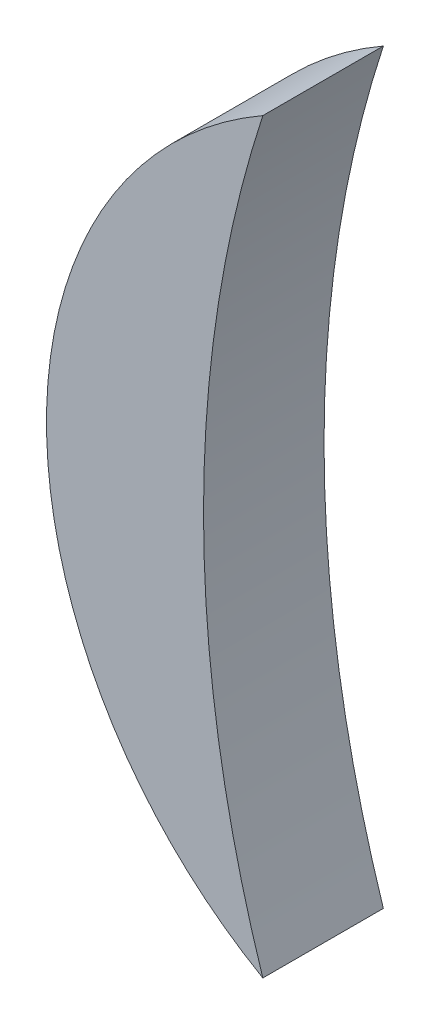
ISO-10303-21;
HEADER;
FILE_DESCRIPTION(('STEP AP214'),'2;1');
FILE_NAME('part.step','',(''),(''),'','','');
FILE_SCHEMA(('AUTOMOTIVE_DESIGN { 1 0 10303 214 1 1 1 1 }'));
ENDSEC;
DATA;
#1=APPLICATION_CONTEXT('core data for automotive mechanical design processes');
#2=APPLICATION_PROTOCOL_DEFINITION('international standard','automotive_design',2000,#1);
#3=PRODUCT_CONTEXT('',#1,'mechanical');
#4=PRODUCT('Part','Part','',(#3));
#5=PRODUCT_RELATED_PRODUCT_CATEGORY('part','',(#4));
#6=PRODUCT_DEFINITION_FORMATION('','',#4);
#7=PRODUCT_DEFINITION_CONTEXT('part definition',#1,'design');
#8=PRODUCT_DEFINITION('design','',#6,#7);
#9=PRODUCT_DEFINITION_SHAPE('','',#8);
#10=(LENGTH_UNIT() NAMED_UNIT(*) SI_UNIT(.MILLI.,.METRE.));
#11=(NAMED_UNIT(*) PLANE_ANGLE_UNIT() SI_UNIT($,.RADIAN.));
#12=(NAMED_UNIT(*) SI_UNIT($,.STERADIAN.) SOLID_ANGLE_UNIT());
#13=UNCERTAINTY_MEASURE_WITH_UNIT(LENGTH_MEASURE(1.E-05),#10,'distance_accuracy_value','');
#14=(GEOMETRIC_REPRESENTATION_CONTEXT(3) GLOBAL_UNCERTAINTY_ASSIGNED_CONTEXT((#13)) GLOBAL_UNIT_ASSIGNED_CONTEXT((#10,
#11,#12)) REPRESENTATION_CONTEXT('',''));
#15=CARTESIAN_POINT('',(0.,0.,0.));
#16=DIRECTION('',(0.,0.,1.));
#17=DIRECTION('',(1.,0.,0.));
#18=AXIS2_PLACEMENT_3D('',#15,#16,#17);
#19=CARTESIAN_POINT('',(92.8169721,102.68697268,0.));
#20=DIRECTION('',(0.,0.,-1.));
#21=DIRECTION('',(1.,0.,0.));
#22=AXIS2_PLACEMENT_3D('',#19,#20,#21);
#23=CYLINDRICAL_SURFACE('',#22,0.3556);
#24=DIRECTION('',(0.,0.,1.));
#25=VECTOR('',#24,1.);
#26=CARTESIAN_POINT('',(92.4788692440639,102.797144449559,0.));
#27=LINE('',#26,#25);
#28=CARTESIAN_POINT('',(92.4788692440639,102.797144449559,0.));
#29=VERTEX_POINT('',#28);
#30=CARTESIAN_POINT('',(92.4788692440639,102.797144449559,0.03556));
#31=VERTEX_POINT('',#30);
#32=EDGE_CURVE('E11',#29,#31,#27,.T.);
#33=ORIENTED_EDGE('',*,*,#32,.T.);
#34=CARTESIAN_POINT('',(92.8169721,102.68697268,0.03556));
#35=DIRECTION('',(0.,0.,1.));
#36=DIRECTION('',(1.,0.,0.));
#37=AXIS2_PLACEMENT_3D('',#34,#35,#36);
#38=CIRCLE('',#37,0.3556);
#39=CARTESIAN_POINT('',(92.4788692440639,102.576800910441,0.03556));
#40=VERTEX_POINT('',#39);
#41=EDGE_CURVE('E24',#31,#40,#38,.T.);
#42=ORIENTED_EDGE('',*,*,#41,.T.);
#43=DIRECTION('',(0.,0.,1.));
#44=VECTOR('',#43,1.);
#45=CARTESIAN_POINT('',(92.4788692440639,102.576800910441,0.));
#46=LINE('',#45,#44);
#47=CARTESIAN_POINT('',(92.4788692440639,102.576800910441,0.));
#48=VERTEX_POINT('',#47);
#49=EDGE_CURVE('E40',#48,#40,#46,.T.);
#50=ORIENTED_EDGE('',*,*,#49,.F.);
#51=CARTESIAN_POINT('',(92.8169721,102.68697268,0.));
#52=DIRECTION('',(0.,0.,1.));
#53=DIRECTION('',(1.,0.,0.));
#54=AXIS2_PLACEMENT_3D('',#51,#52,#53);
#55=CIRCLE('',#54,0.3556);
#56=EDGE_CURVE('E42',#29,#48,#55,.T.);
#57=ORIENTED_EDGE('',*,*,#56,.F.);
#58=EDGE_LOOP('',(#33,#42,#50,#57));
#59=FACE_BOUND('',#58,.T.);
#60=ADVANCED_FACE('F17',(#59),#23,.F.);
#61=CARTESIAN_POINT('',(92.54204504,102.68697268,0.));
#62=DIRECTION('',(0.,0.,-1.));
#63=DIRECTION('',(-1.11896493820492E-13,1.,0.));
#64=AXIS2_PLACEMENT_3D('',#61,#62,#63);
#65=CYLINDRICAL_SURFACE('',#64,0.127);
#66=CARTESIAN_POINT('',(92.54204504,102.68697268,0.03556));
#67=DIRECTION('',(0.,0.,1.));
#68=DIRECTION('',(-1.11896493820492E-13,1.,0.));
#69=AXIS2_PLACEMENT_3D('',#66,#67,#68);
#70=CIRCLE('',#69,0.127);
#71=EDGE_CURVE('E49',#31,#40,#70,.T.);
#72=ORIENTED_EDGE('',*,*,#71,.F.);
#73=ORIENTED_EDGE('',*,*,#32,.F.);
#74=CARTESIAN_POINT('',(92.54204504,102.68697268,0.));
#75=DIRECTION('',(0.,0.,1.));
#76=DIRECTION('',(-1.11896493820492E-13,1.,0.));
#77=AXIS2_PLACEMENT_3D('',#74,#75,#76);
#78=CIRCLE('',#77,0.127);
#79=EDGE_CURVE('E48',#29,#48,#78,.T.);
#80=ORIENTED_EDGE('',*,*,#79,.T.);
#81=ORIENTED_EDGE('',*,*,#49,.T.);
#82=EDGE_LOOP('',(#72,#73,#80,#81));
#83=FACE_BOUND('',#82,.T.);
#84=ADVANCED_FACE('F51',(#83),#65,.T.);
#85=CARTESIAN_POINT('',(92.54204504,102.55997268,0.));
#86=DIRECTION('',(0.,0.,-1.));
#87=DIRECTION('',(-1.,0.,0.));
#88=AXIS2_PLACEMENT_3D('',#85,#86,#87);
#89=PLANE('',#88);
#90=ORIENTED_EDGE('',*,*,#56,.T.);
#91=ORIENTED_EDGE('',*,*,#79,.F.);
#92=EDGE_LOOP('',(#90,#91));
#93=FACE_BOUND('',#92,.T.);
#94=ADVANCED_FACE('F47',(#93),#89,.T.);
#95=CARTESIAN_POINT('',(92.54204504,102.55997268,0.03556));
#96=DIRECTION('',(0.,0.,-1.));
#97=DIRECTION('',(-1.,0.,0.));
#98=AXIS2_PLACEMENT_3D('',#95,#96,#97);
#99=PLANE('',#98);
#100=ORIENTED_EDGE('',*,*,#71,.T.);
#101=ORIENTED_EDGE('',*,*,#41,.F.);
#102=EDGE_LOOP('',(#100,#101));
#103=FACE_BOUND('',#102,.T.);
#104=ADVANCED_FACE('F55',(#103),#99,.F.);
#105=CLOSED_SHELL('',(#60,#84,#94,#104));
#106=MANIFOLD_SOLID_BREP('B1',#105);
#107=ADVANCED_BREP_SHAPE_REPRESENTATION('',(#18,#106),#14);
#108=SHAPE_DEFINITION_REPRESENTATION(#9,#107);
ENDSEC;
END-ISO-10303-21;
